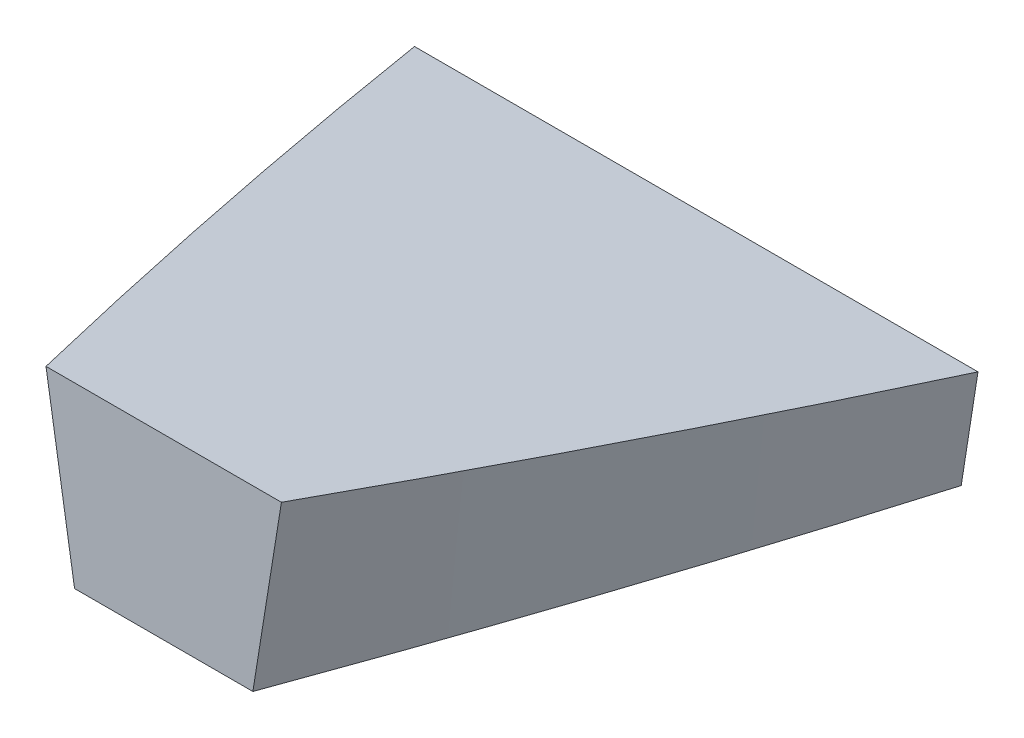
ISO-10303-21;
HEADER;
FILE_DESCRIPTION(('STEP AP214'),'2;1');
FILE_NAME('part.step','',(''),(''),'','','');
FILE_SCHEMA(('AUTOMOTIVE_DESIGN { 1 0 10303 214 1 1 1 1 }'));
ENDSEC;
DATA;
#1=APPLICATION_CONTEXT('core data for automotive mechanical design processes');
#2=APPLICATION_PROTOCOL_DEFINITION('international standard','automotive_design',2000,#1);
#3=PRODUCT_CONTEXT('',#1,'mechanical');
#4=PRODUCT('Part','Part','',(#3));
#5=PRODUCT_RELATED_PRODUCT_CATEGORY('part','',(#4));
#6=PRODUCT_DEFINITION_FORMATION('','',#4);
#7=PRODUCT_DEFINITION_CONTEXT('part definition',#1,'design');
#8=PRODUCT_DEFINITION('design','',#6,#7);
#9=PRODUCT_DEFINITION_SHAPE('','',#8);
#10=(LENGTH_UNIT() NAMED_UNIT(*) SI_UNIT(.MILLI.,.METRE.));
#11=(NAMED_UNIT(*) PLANE_ANGLE_UNIT() SI_UNIT($,.RADIAN.));
#12=(NAMED_UNIT(*) SI_UNIT($,.STERADIAN.) SOLID_ANGLE_UNIT());
#13=UNCERTAINTY_MEASURE_WITH_UNIT(LENGTH_MEASURE(1.E-05),#10,'distance_accuracy_value','');
#14=(GEOMETRIC_REPRESENTATION_CONTEXT(3) GLOBAL_UNCERTAINTY_ASSIGNED_CONTEXT((#13)) GLOBAL_UNIT_ASSIGNED_CONTEXT((#10,
#11,#12)) REPRESENTATION_CONTEXT('',''));
#15=CARTESIAN_POINT('',(0.,0.,0.));
#16=DIRECTION('',(0.,0.,1.));
#17=DIRECTION('',(1.,0.,0.));
#18=AXIS2_PLACEMENT_3D('',#15,#16,#17);
#19=CARTESIAN_POINT('',(0.,0.,1033.18442870201));
#20=DIRECTION('',(0.,0.,-1.));
#21=DIRECTION('',(-1.,0.,0.));
#22=AXIS2_PLACEMENT_3D('',#19,#20,#21);
#23=PLANE('',#22);
#24=DIRECTION('',(1.,0.,0.));
#25=VECTOR('',#24,1.);
#26=CARTESIAN_POINT('',(-123.764421645396,0.,1033.18442870201));
#27=LINE('',#26,#25);
#28=CARTESIAN_POINT('',(-106.025683326442,0.,1033.18442870118));
#29=VERTEX_POINT('',#28);
#30=CARTESIAN_POINT('',(121.462133420714,0.,1033.18442870116));
#31=VERTEX_POINT('',#30);
#32=EDGE_CURVE('E104',#29,#31,#27,.T.);
#33=ORIENTED_EDGE('',*,*,#32,.F.);
#34=CARTESIAN_POINT('',(-118.106470541406,76.9365767459715,1033.18442870201));
#35=CARTESIAN_POINT('',(-116.093228938327,64.1137736749483,1033.18442870201));
#36=CARTESIAN_POINT('',(-114.079859067178,51.290990745257,1033.18442870201));
#37=CARTESIAN_POINT('',(-110.052862787958,25.6454651635593,1033.18442870202));
#38=CARTESIAN_POINT('',(-108.039236379886,12.8227225115528,1033.18442870202));
#39=CARTESIAN_POINT('',(-106.025481703744,8.78260368680306E-10,1033.18442870203));
#40=B_SPLINE_CURVE_WITH_KNOTS('',3,(#34,#35,#36,#37,#38,#39),.UNSPECIFIED.,.F.,.F.,(4,2,4),(0.,
38.9396556571869,77.8793113294938),.UNSPECIFIED.);
#41=CARTESIAN_POINT('',(-113.229700788441,45.8769360412904,1033.18442870201));
#42=VERTEX_POINT('',#41);
#43=EDGE_CURVE('E91',#42,#29,#40,.T.);
#44=ORIENTED_EDGE('',*,*,#43,.F.);
#45=DIRECTION('',(1.,0.,0.));
#46=VECTOR('',#45,1.);
#47=CARTESIAN_POINT('',(0.,45.8769360412903,1033.18442870201));
#48=LINE('',#47,#46);
#49=CARTESIAN_POINT('',(128.666146601839,45.8769360412903,1033.18442870201));
#50=VERTEX_POINT('',#49);
#51=EDGE_CURVE('E102',#42,#50,#48,.T.);
#52=ORIENTED_EDGE('',*,*,#51,.T.);
#53=CARTESIAN_POINT('',(121.46192751701,0.,1033.18442870201));
#54=CARTESIAN_POINT('',(123.475682192377,12.8227225057619,1033.18442870201));
#55=CARTESIAN_POINT('',(125.489308599675,25.6454651528556,1033.18442870201));
#56=CARTESIAN_POINT('',(129.51630487894,51.290990734846,1033.18442870201));
#57=CARTESIAN_POINT('',(131.529674750906,64.1137736697428,1033.18442870201));
#58=CARTESIAN_POINT('',(133.542916354803,76.9365767459714,1033.18442870201));
#59=B_SPLINE_CURVE_WITH_KNOTS('',3,(#53,#54,#55,#56,#57,#58),.UNSPECIFIED.,.F.,.F.,(4,2,4),(0.,
38.939655657387,77.8793113303819),.UNSPECIFIED.);
#60=EDGE_CURVE('E105',#31,#50,#59,.T.);
#61=ORIENTED_EDGE('',*,*,#60,.F.);
#62=EDGE_LOOP('',(#33,#44,#52,#61));
#63=FACE_BOUND('',#62,.T.);
#64=ADVANCED_FACE('F34',(#63),#23,.T.);
#65=CARTESIAN_POINT('',(-123.764421645396,0.,971.228223196015));
#66=DIRECTION('',(0.,-1.,0.));
#67=DIRECTION('',(0.,0.,-1.));
#68=AXIS2_PLACEMENT_3D('',#65,#66,#67);
#69=PLANE('',#68);
#70=CARTESIAN_POINT('',(-170.289770142453,0.,785.339473226677));
#71=CARTESIAN_POINT('',(-167.825772421889,0.,796.353082344623));
#72=CARTESIAN_POINT('',(-160.999165467227,0.,826.241748411276));
#73=CARTESIAN_POINT('',(-149.252675491013,0.,874.959703685039));
#74=CARTESIAN_POINT('',(-120.211836445313,0.,987.796815406518));
#75=CARTESIAN_POINT('',(-92.3477273162206,0.,1081.13996125716));
#76=CARTESIAN_POINT('',(-67.767522398365,0.,1155.10442870201));
#77=B_SPLINE_CURVE_WITH_KNOTS('',3,(#70,#71,#72,#73,#74,#75,#76),.UNSPECIFIED.,.F.,.F.,(4,1,1,1,
4),(0.794288290696745,0.8125,0.84375,0.875,1.),.UNSPECIFIED.);
#78=CARTESIAN_POINT('',(-67.7675223983649,0.,1155.10442870201));
#79=VERTEX_POINT('',#78);
#80=EDGE_CURVE('E48',#29,#79,#77,.T.);
#81=ORIENTED_EDGE('',*,*,#80,.F.);
#82=ORIENTED_EDGE('',*,*,#32,.T.);
#83=CARTESIAN_POINT('',(83.2039682117622,0.,1155.10442870201));
#84=CARTESIAN_POINT('',(107.784173129618,0.,1081.13996125716));
#85=CARTESIAN_POINT('',(135.64828225871,0.,987.796815406518));
#86=CARTESIAN_POINT('',(164.68912130441,0.,874.959703685039));
#87=CARTESIAN_POINT('',(176.435611280623,0.,826.241748411283));
#88=CARTESIAN_POINT('',(183.262218235284,0.,796.353082344636));
#89=CARTESIAN_POINT('',(185.726215955846,0.,785.339473226696));
#90=B_SPLINE_CURVE_WITH_KNOTS('',3,(#83,#84,#85,#86,#87,#88,#89),.UNSPECIFIED.,.F.,.F.,(4,1,1,1,
4),(0.00273138969491729,0.127731389694917,0.158981389694917,0.190231389694917,
0.208443098998162),.UNSPECIFIED.);
#91=CARTESIAN_POINT('',(83.2039682117622,0.,1155.10442870201));
#92=VERTEX_POINT('',#91);
#93=EDGE_CURVE('E97',#92,#31,#90,.T.);
#94=ORIENTED_EDGE('',*,*,#93,.F.);
#95=CARTESIAN_POINT('',(35.2929058352083,0.,1290.66144621356));
#96=CARTESIAN_POINT('',(52.2219313725927,0.,1245.49766233588));
#97=CARTESIAN_POINT('',(67.9931249046609,0.,1200.87548424678));
#98=CARTESIAN_POINT('',(83.2039682117621,0.,1155.10442870201));
#99=B_SPLINE_CURVE_WITH_KNOTS('',3,(#95,#96,#97,#98),.UNSPECIFIED.,.F.,.F.,(4,4),(0.,1.),.UNSPECIFIED.);
#100=CARTESIAN_POINT('',(45.9859426583799,0.,1261.78442870294));
#101=VERTEX_POINT('',#100);
#102=EDGE_CURVE('E56',#101,#92,#99,.T.);
#103=ORIENTED_EDGE('',*,*,#102,.F.);
#104=DIRECTION('',(1.,0.,0.));
#105=VECTOR('',#104,1.);
#106=CARTESIAN_POINT('',(-123.764421645396,0.,1261.78442870201));
#107=LINE('',#106,#105);
#108=CARTESIAN_POINT('',(-30.5494957021117,0.,1261.78442870296));
#109=VERTEX_POINT('',#108);
#110=EDGE_CURVE('E228',#109,#101,#107,.T.);
#111=ORIENTED_EDGE('',*,*,#110,.F.);
#112=CARTESIAN_POINT('',(-67.7675223983649,0.,1155.10442870201));
#113=CARTESIAN_POINT('',(-52.556679091263,0.,1200.87548424678));
#114=CARTESIAN_POINT('',(-36.7854855591942,0.,1245.49766233588));
#115=CARTESIAN_POINT('',(-19.8564600218092,0.,1290.66144621356));
#116=B_SPLINE_CURVE_WITH_KNOTS('',3,(#112,#113,#114,#115),.UNSPECIFIED.,.F.,.F.,(4,4),(0.,1.),.UNSPECIFIED.);
#117=EDGE_CURVE('E221',#79,#109,#116,.T.);
#118=ORIENTED_EDGE('',*,*,#117,.F.);
#119=EDGE_LOOP('',(#81,#82,#94,#103,#111,#118));
#120=FACE_BOUND('',#119,.T.);
#121=ADVANCED_FACE('F122',(#120),#69,.T.);
#122=CARTESIAN_POINT('',(7.71822290670033,0.,1345.60442870201));
#123=CARTESIAN_POINT('',(7.71822290670033,87.6979944450598,1358.81242870201));
#124=CARTESIAN_POINT('',(8.10743528494052,0.,1345.60442870201));
#125=CARTESIAN_POINT('',(8.12724026827437,87.6979944450598,1358.81242870201));
#126=CARTESIAN_POINT('',(8.75508571448784,0.,1345.56052568011));
#127=CARTESIAN_POINT('',(8.97319661845631,87.6979944450598,1358.79028540965));
#128=CARTESIAN_POINT('',(9.57165843202123,0.,1345.43316148124));
#129=CARTESIAN_POINT('',(10.3317431818745,87.6979944450598,1358.67503744139));
#130=CARTESIAN_POINT('',(10.2875514797332,0.,1345.26000515088));
#131=CARTESIAN_POINT('',(11.7857489404816,87.6979944450598,1358.46215329079));
#132=CARTESIAN_POINT('',(10.939690496394,0.,1345.05110001895));
#133=CARTESIAN_POINT('',(13.3334694360532,87.6979944450599,1358.12767564935));
#134=CARTESIAN_POINT('',(11.5420185527259,0.,1344.8100390265));
#135=CARTESIAN_POINT('',(14.9731602103647,87.69799444506,1357.64764720858));
#136=CARTESIAN_POINT('',(12.1067615852056,0.,1344.53968217589));
#137=CARTESIAN_POINT('',(16.6812255493726,87.69799444506,1356.99910216844));
#138=CARTESIAN_POINT('',(12.6402833982277,0.,1344.2403693277));
#139=CARTESIAN_POINT('',(18.434069739033,87.6979944450598,1356.15907472886));
#140=CARTESIAN_POINT('',(13.3168386236998,0.,1343.80209911395));
#141=CARTESIAN_POINT('',(20.7517811937159,87.6979944450596,1354.7927744667));
#142=CARTESIAN_POINT('',(14.1062560887791,0.,1343.17660371854));
#143=CARTESIAN_POINT('',(23.4641703921966,87.6979944450602,1352.64011635232));
#144=CARTESIAN_POINT('',(14.8383357387118,0.,1342.42913276985));
#145=CARTESIAN_POINT('',(25.5743560699719,87.6979944450597,1350.23081224927));
#146=CARTESIAN_POINT('',(15.3956799874643,0.,1341.72606263573));
#147=CARTESIAN_POINT('',(26.8838781864801,87.6979944450598,1348.33532915411));
#148=CARTESIAN_POINT('',(15.8008931441622,0.,1341.13074011889));
#149=CARTESIAN_POINT('',(27.6978449139644,87.69799444506,1346.94918772532));
#150=CARTESIAN_POINT('',(16.19576757427,0.,1340.43886716429));
#151=CARTESIAN_POINT('',(28.3647751345112,87.6979944450599,1345.61800798807));
#152=CARTESIAN_POINT('',(16.4539963903093,0.,1339.88077053606));
#153=CARTESIAN_POINT('',(28.7242973925143,87.6979944450598,1344.76942443889));
#154=CARTESIAN_POINT('',(17.9991736902126,0.,1335.92494004421));
#155=CARTESIAN_POINT('',(30.6575133581101,87.6979944450598,1339.82017061247));
#156=CARTESIAN_POINT('',(20.9583644565766,0.,1328.31624623871));
#157=CARTESIAN_POINT('',(33.9711236854347,87.6979944450599,1331.28696766163));
#158=CARTESIAN_POINT('',(25.7087778762393,0.,1315.97896954419));
#159=CARTESIAN_POINT('',(38.6118840613012,87.6979944450598,1319.21404001281));
#160=CARTESIAN_POINT('',(30.5900218898954,0.,1303.16468405729));
#161=CARTESIAN_POINT('',(43.1130656286996,87.6979944450598,1307.38696175443));
#162=CARTESIAN_POINT('',(33.7618140160018,0.,1294.74614086275));
#163=CARTESIAN_POINT('',(46.1242016708984,87.6979944450598,1299.39618007328));
#164=CARTESIAN_POINT('',(39.4984380448584,0.,1279.44179583334));
#165=CARTESIAN_POINT('',(51.8807345406513,87.6979944450598,1284.03872161536));
#166=CARTESIAN_POINT('',(47.8117583688451,0.,1256.94835030993));
#167=CARTESIAN_POINT('',(60.2086698415953,87.6979944450599,1261.49759678602));
#168=CARTESIAN_POINT('',(59.9647251773283,0.,1223.07960866854));
#169=CARTESIAN_POINT('',(72.3767562145426,87.6979944450598,1227.58155508116));
#170=CARTESIAN_POINT('',(71.7841981742406,0.,1189.11917820836));
#171=CARTESIAN_POINT('',(84.2326703371387,87.6979944450599,1193.5282528031));
#172=CARTESIAN_POINT('',(79.4355673743826,0.,1166.44395015788));
#173=CARTESIAN_POINT('',(91.9353949608194,87.6979944450599,1170.71212469187));
#174=CARTESIAN_POINT('',(88.2533566011425,0.,1139.91027859664));
#175=CARTESIAN_POINT('',(100.833142003973,87.6979944450598,1143.93786245568));
#176=CARTESIAN_POINT('',(98.1817923383555,0.,1109.39198516259));
#177=CARTESIAN_POINT('',(110.807039872266,87.6979944450598,1113.27461380874));
#178=CARTESIAN_POINT('',(112.532151848529,0.,1063.30970180671));
#179=CARTESIAN_POINT('',(125.14960295021,87.6979944450599,1067.21221326498));
#180=CARTESIAN_POINT('',(126.308946292052,0.,1017.00771171111));
#181=CARTESIAN_POINT('',(138.898865364075,87.6979944450598,1021.01316850358));
#182=CARTESIAN_POINT('',(139.487666783876,0.,970.575088797343));
#183=CARTESIAN_POINT('',(152.075597865083,87.69799444506,974.607706070568));
#184=CARTESIAN_POINT('',(149.951114829771,0.,931.846603955364));
#185=CARTESIAN_POINT('',(162.593313858213,87.6979944450598,935.704958203181));
#186=CARTESIAN_POINT('',(158.003037124975,0.,900.886527714706));
#187=CARTESIAN_POINT('',(170.736556652266,87.6979944450599,904.406622450725));
#188=CARTESIAN_POINT('',(163.880674594839,0.,877.688699120982));
#189=CARTESIAN_POINT('',(176.709711229527,87.6979944450598,880.834991629654));
#190=CARTESIAN_POINT('',(169.595121632379,0.,854.523971884333));
#191=CARTESIAN_POINT('',(182.549049136345,87.6979944450599,857.155352899428));
#192=CARTESIAN_POINT('',(174.220707413563,0.,835.255863704768));
#193=CARTESIAN_POINT('',(187.30514711943,87.6979944450598,837.323832101492));
#194=CARTESIAN_POINT('',(177.839027154552,0.,819.867823903748));
#195=CARTESIAN_POINT('',(191.045799873853,87.6979944450599,821.394466199786));
#196=CARTESIAN_POINT('',(180.511623309841,0.,808.341254432311));
#197=CARTESIAN_POINT('',(193.819261494727,87.6979944450597,809.413958557279));
#198=CARTESIAN_POINT('',(183.143006606201,0.,796.830382348215));
#199=CARTESIAN_POINT('',(196.55908898365,87.6979944450599,797.398158617155));
#200=CARTESIAN_POINT('',(184.869740758839,0.,789.167757222384));
#201=CARTESIAN_POINT('',(198.360276505289,87.6979944450598,789.36247149621));
#202=CARTESIAN_POINT('',(185.726215955846,0.,785.339473226696));
#203=CARTESIAN_POINT('',(199.260723543644,87.6979944450598,785.339473226529));
#204=B_SPLINE_SURFACE_WITH_KNOTS('',3,1,((#122,#123),(#124,#125),(#126,#127),(#128,#129),(#130,
#131),(#132,#133),(#134,#135),(#136,#137),(#138,#139),(#140,#141),(#142,#143),(#144,#145),(#146,
#147),(#148,#149),(#150,#151),(#152,#153),(#154,#155),(#156,#157),(#158,#159),(#160,#161),(#162,
#163),(#164,#165),(#166,#167),(#168,#169),(#170,#171),(#172,#173),(#174,#175),(#176,#177),(#178,
#179),(#180,#181),(#182,#183),(#184,#185),(#186,#187),(#188,#189),(#190,#191),(#192,#193),(#194,
#195),(#196,#197),(#198,#199),(#200,#201),(#202,#203)),.UNSPECIFIED.,.F.,.F.,.F.,(4,1,1,1,1,1,1,
1,1,1,1,1,1,1,2,1,1,1,2,1,1,1,2,1,1,1,1,1,1,1,1,1,1,1,1,4),(2,2),(0.,0.00198924260783937,
0.00397848521567873,0.0059677278235181,0.00795697043135747,0.00994621303919684,
0.0119354556470362,0.0139246982548756,0.0159139408627149,0.0198924260783937,0.0238709112940724,
0.0258601539019118,0.0278493965097511,0.0298386391175905,0.0318278817254299,0.0536185184832892,
0.0754091552411486,0.0971997919990079,0.118990428756867,0.178843942173828,0.238697455590788,
0.298550969007749,0.358404482424709,0.43860392212162,0.518803361818532,0.599002801515443,
0.679202241212355,0.759401680909266,0.799501400757722,0.839601120606178,0.879700840454633,
0.919800560303089,0.939850420227317,0.959900280151544,0.979950140075772,1.),(0.,1.),.UNSPECIFIED.);
#205=CARTESIAN_POINT('',(28.3542757226073,87.6979944450512,1345.60442870188));
#206=CARTESIAN_POINT('',(28.3879306663669,87.6877464233605,1345.52787188919));
#207=CARTESIAN_POINT('',(28.4211548852475,87.6774734998239,1345.45112904974));
#208=CARTESIAN_POINT('',(28.4867385478705,87.6568785590083,1345.29727662097));
#209=CARTESIAN_POINT('',(28.5190979475732,87.6465565392606,1345.22016701321));
#210=CARTESIAN_POINT('',(28.5829299206545,87.6258701175173,1345.06563118538));
#211=CARTESIAN_POINT('',(28.6144029117256,87.615505738211,1344.98820513481));
#212=CARTESIAN_POINT('',(28.6764753345324,87.5947314138247,1344.83301263915));
#213=CARTESIAN_POINT('',(28.707074793412,87.5843214701721,1344.75524620473));
#214=CARTESIAN_POINT('',(28.7673957652413,87.5634562101125,1344.59937438329));
#215=CARTESIAN_POINT('',(28.797117229646,87.5530008912331,1344.52126897781));
#216=CARTESIAN_POINT('',(28.8337309472117,87.5399052794955,1344.42343953075));
#217=CARTESIAN_POINT('',(28.8410269212745,87.5372847847293,1344.40386338882));
#218=CARTESIAN_POINT('',(28.8555555902512,87.5320407068096,1344.36468803348));
#219=CARTESIAN_POINT('',(28.8627882851086,87.5294171236532,1344.34508882005));
#220=CARTESIAN_POINT('',(28.8844844338459,87.5215462674478,1344.28629038238));
#221=CARTESIAN_POINT('',(28.8989459127189,87.5162989018668,1344.2470904669));
#222=CARTESIAN_POINT('',(28.9423238847888,87.500558815622,1344.12950573967));
#223=CARTESIAN_POINT('',(28.9712395693672,87.4900660533257,1344.05112061692));
#224=CARTESIAN_POINT('',(29.0290647612209,87.4690803638671,1343.8943491398));
#225=CARTESIAN_POINT('',(29.0579742685616,87.458587436708,1343.81596278546));
#226=CARTESIAN_POINT('',(29.1446998504573,87.4271066599672,1343.58078881702));
#227=CARTESIAN_POINT('',(29.2025084820928,87.4061184489687,1343.42399850299));
#228=CARTESIAN_POINT('',(29.3181062190722,87.3641406201502,1343.11040736541));
#229=CARTESIAN_POINT('',(29.3758953240164,87.3431510023109,1342.95360654172));
#230=CARTESIAN_POINT('',(29.5203303872624,87.2906800754465,1342.56162777321));
#231=CARTESIAN_POINT('',(29.6069635069627,87.2591981442435,1342.32644518047));
#232=CARTESIAN_POINT('',(29.7801815216338,87.1962326218115,1341.85606759394));
#233=CARTESIAN_POINT('',(29.8667664174863,87.1647490306253,1341.62087260046));
#234=CARTESIAN_POINT('',(30.0398916252046,87.1017787810815,1341.15045970052));
#235=CARTESIAN_POINT('',(30.1264319358776,87.0702921226664,1340.91524179362));
#236=CARTESIAN_POINT('',(30.2994660105385,87.0073163685569,1340.44478777237));
#237=CARTESIAN_POINT('',(30.3859597742814,86.9758272728509,1340.20955165793));
#238=CARTESIAN_POINT('',(30.5588989787113,86.912847225466,1339.73906556421));
#239=CARTESIAN_POINT('',(30.6453444200326,86.8813562738178,1339.50381558514));
#240=CARTESIAN_POINT('',(30.8181878962516,86.8183721316128,1339.03329890147));
#241=CARTESIAN_POINT('',(30.904585931217,86.7868789410593,1338.79803219689));
#242=CARTESIAN_POINT('',(31.1637081390655,86.6923962409372,1338.09220871229));
#243=CARTESIAN_POINT('',(31.3363612462995,86.6294033001337,1337.62162629958));
#244=CARTESIAN_POINT('',(31.6814745723598,86.503409420895,1336.68040172866));
#245=CARTESIAN_POINT('',(31.8539347946524,86.440408482627,1336.20975957169));
#246=CARTESIAN_POINT('',(32.1986662592395,86.3143973892435,1335.26840640423));
#247=CARTESIAN_POINT('',(32.3709375012264,86.2513872341131,1334.79769539363));
#248=CARTESIAN_POINT('',(32.7152926927309,86.1253576172754,1333.85620384857));
#249=CARTESIAN_POINT('',(32.8873766414624,86.0623381555303,1333.38542331384));
#250=CARTESIAN_POINT('',(33.2313582233911,85.9362903164879,1332.44379564164));
#251=CARTESIAN_POINT('',(33.4032558566795,85.873261939195,1331.97294850421));
#252=CARTESIAN_POINT('',(33.918675436055,85.6841632987642,1330.56030617763));
#253=CARTESIAN_POINT('',(34.2619231097363,85.5580798754774,1329.61841267692));
#254=CARTESIAN_POINT('',(35.289333171038,85.1802224131156,1326.79566660361));
#255=CARTESIAN_POINT('',(35.9723816571374,84.9283950341645,1324.91441556084));
#256=CARTESIAN_POINT('',(37.3354836137527,84.4245976406602,1321.15084793041));
#257=CARTESIAN_POINT('',(38.0155370838956,84.1726276260893,1319.26853134262));
#258=CARTESIAN_POINT('',(40.0512055244051,83.416506144739,1313.62000205571));
#259=CARTESIAN_POINT('',(41.4023325206466,82.9121417707696,1309.85219885488));
#260=CARTESIAN_POINT('',(43.4200914958721,82.1551771232522,1304.19737078013));
#261=CARTESIAN_POINT('',(44.091188526748,81.9027861611387,1302.31190954617));
#262=CARTESIAN_POINT('',(45.430369620569,81.397863553069,1298.53993611379));
#263=CARTESIAN_POINT('',(46.098453683534,81.1453319071137,1296.65342391538));
#264=CARTESIAN_POINT('',(48.0982927947397,80.3875063580054,1290.9921645621));
#265=CARTESIAN_POINT('',(49.4255743320841,79.8820045163765,1287.21586402381));
#266=CARTESIAN_POINT('',(52.0681706481596,78.8704485194893,1279.65913694397));
#267=CARTESIAN_POINT('',(53.3834853850964,78.3643943623088,1275.87871038805));
#268=CARTESIAN_POINT('',(56.0021441654757,77.3517371471793,1268.31375676836));
#269=CARTESIAN_POINT('',(57.3054881167027,76.8451340850353,1264.52922967326));
#270=CARTESIAN_POINT('',(62.4979482356536,74.8164329143873,1249.37402213129));
#271=CARTESIAN_POINT('',(66.3389809676814,73.2921623456982,1237.98711253966));
#272=CARTESIAN_POINT('',(73.9122756854502,70.2388313741763,1215.1775113834));
#273=CARTESIAN_POINT('',(77.6445350034631,68.709770854884,1203.75481894876));
#274=CARTESIAN_POINT('',(83.1610577718104,66.4127117347571,1186.59487040367));
#275=CARTESIAN_POINT('',(84.9862697693365,65.646440657459,1180.8705195836));
#276=CARTESIAN_POINT('',(88.6094907882526,64.1127664822113,1169.41336129734));
#277=CARTESIAN_POINT('',(90.4074998060704,63.345363384113,1163.68055383004));
#278=CARTESIAN_POINT('',(93.976286495846,61.8094399437921,1152.20659263584));
#279=CARTESIAN_POINT('',(95.7470640528832,61.0409195968696,1146.46543887384));
#280=CARTESIAN_POINT('',(99.2612362345347,59.5027776537149,1134.97490457792));
#281=CARTESIAN_POINT('',(101.004630860706,58.7331560575455,1129.22552404446));
#282=CARTESIAN_POINT('',(104.464204352275,57.1927769135677,1117.71827696536));
#283=CARTESIAN_POINT('',(106.180381268507,56.4220192886854,1111.96040984395));
#284=CARTESIAN_POINT('',(109.585373179143,54.8794415279702,1100.4367382202));
#285=CARTESIAN_POINT('',(111.274188172624,54.1076213921015,1094.6709337176));
#286=CARTESIAN_POINT('',(116.299494027293,51.7906024116557,1077.36187704854));
#287=CARTESIAN_POINT('',(119.594879164864,50.2438301219454,1065.80687061887));
#288=CARTESIAN_POINT('',(126.075677194496,47.1462521306516,1042.66672656281));
#289=CARTESIAN_POINT('',(129.261090998751,45.5954464626391,1031.08158918721));
#290=CARTESIAN_POINT('',(135.521844403432,42.4899438192718,1007.88224481688));
#291=CARTESIAN_POINT('',(138.597185087343,40.9352468823815,996.26803810949));
#292=CARTESIAN_POINT('',(144.4748613613,37.905832426501,973.637102871828));
#293=CARTESIAN_POINT('',(147.282982951758,36.431312420809,962.621849844737));
#294=CARTESIAN_POINT('',(152.800066256829,33.4790191396748,940.567040566911));
#295=CARTESIAN_POINT('',(155.509028694028,32.0012458880226,929.527484493898));
#296=CARTESIAN_POINT('',(159.498020802643,29.7822377247431,912.950607752077));
#297=CARTESIAN_POINT('',(160.815275500431,29.0421773887134,907.422061631839));
#298=CARTESIAN_POINT('',(163.424919006405,27.5612847712009,896.359202650691));
#299=CARTESIAN_POINT('',(164.717307815969,26.820452489761,890.824889790102));
#300=CARTESIAN_POINT('',(167.276945658572,25.3381341109741,879.751379803112));
#301=CARTESIAN_POINT('',(168.54419821727,24.596648120775,874.21218347715));
#302=CARTESIAN_POINT('',(171.053744156258,23.112932900322,863.128238525338));
#303=CARTESIAN_POINT('',(172.296037535277,22.3707036700303,857.583489899205));
#304=CARTESIAN_POINT('',(174.755721700677,20.8855163445501,846.488547735218));
#305=CARTESIAN_POINT('',(175.97311239199,20.1425582465904,840.938354176663));
#306=CARTESIAN_POINT('',(178.383056871448,18.6559330152123,829.83267028165));
#307=CARTESIAN_POINT('',(179.575610660528,17.9122658818207,824.277179945392));
#308=CARTESIAN_POINT('',(181.345773191091,16.7962416474497,815.940033430928));
#309=CARTESIAN_POINT('',(181.932718337175,16.424144812814,813.1603215462));
#310=CARTESIAN_POINT('',(183.10033839059,15.6797778843162,807.599603461162));
#311=CARTESIAN_POINT('',(183.681013297918,15.3075077904541,804.818597260852));
#312=CARTESIAN_POINT('',(184.547270918051,14.7489729252328,800.646118867127));
#313=CARTESIAN_POINT('',(184.835231024138,14.5627730011828,799.255131108996));
#314=CARTESIAN_POINT('',(185.409548193949,14.1903296226686,796.472830403166));
#315=CARTESIAN_POINT('',(185.695905257626,14.0040861682032,795.081517455456));
#316=CARTESIAN_POINT('',(186.26709213078,13.6315580433983,792.298583661005));
#317=CARTESIAN_POINT('',(186.551921940235,13.4452733730582,790.90696281426));
#318=CARTESIAN_POINT('',(187.120134844813,13.0726652121866,788.123431118442));
#319=CARTESIAN_POINT('',(187.403517940072,12.8863417216587,786.731520269398));
#320=CARTESIAN_POINT('',(187.68621797702,12.7000000000191,785.339473226672));
#321=B_SPLINE_CURVE_WITH_KNOTS('',3,(#205,#206,#207,#208,#209,#210,#211,#212,#213,#214,#215,
#216,#217,#218,#219,#220,#221,#222,#223,#224,#225,#226,#227,#228,#229,#230,#231,#232,#233,#234,
#235,#236,#237,#238,#239,#240,#241,#242,#243,#244,#245,#246,#247,#248,#249,#250,#251,#252,#253,
#254,#255,#256,#257,#258,#259,#260,#261,#262,#263,#264,#265,#266,#267,#268,#269,#270,#271,#272,
#273,#274,#275,#276,#277,#278,#279,#280,#281,#282,#283,#284,#285,#286,#287,#288,#289,#290,#291,
#292,#293,#294,#295,#296,#297,#298,#299,#300,#301,#302,#303,#304,#305,#306,#307,#308,#309,#310,
#311,#312,#313,#314,#315,#316,#317,#318,#319,#320),.UNSPECIFIED.,.F.,.F.,(4,2,2,2,2,2,2,2,2,2,2,
2,2,2,2,2,2,2,2,2,2,2,2,2,2,2,2,2,2,2,2,2,2,2,2,2,2,2,2,2,2,2,2,2,2,2,2,2,2,2,2,2,2,2,2,2,2,4),
(0.,0.252758677415496,0.505530201775004,0.758180551877242,1.01082304263365,1.26347947617553,
1.3266451664708,1.38981091307026,1.51614274827675,1.76875701267162,2.02136845064755,
2.52663066190693,3.03190265526551,3.78970562655304,4.54749425403109,5.30530219882549,
6.06311409318998,6.82091579227358,7.5787164044546,9.0943103425807,10.6098765926928,
12.1254453051727,13.6410203541298,15.156594661984,18.18775165711,24.2393353143097,
30.2909197251815,42.3940532227149,48.4456071231867,54.497160983817,66.6008124726872,
78.7045062174125,90.808293123323,127.148419423029,163.489436235677,181.660259180327,
199.831084511031,218.001986504127,236.172887464089,254.345083889658,272.51728092724,
308.861324124873,345.205065782104,381.548449597587,415.936380805701,450.324061374877,
467.51788158563,484.711700842831,501.90309116007,519.094482352561,536.285939162155,
553.477395324433,562.073192696889,570.668990075253,574.96688945227,579.264788955168,
583.562688517981,587.860587675631),.UNSPECIFIED.);
#322=CARTESIAN_POINT('',(58.2457398478888,76.477710483073,1261.78442870201));
#323=VERTEX_POINT('',#322);
#324=EDGE_CURVE('E11',#323,#50,#321,.T.);
#325=CARTESIAN_POINT('',(45.9860815401597,0.,1261.78442870201));
#326=CARTESIAN_POINT('',(48.3296623028588,14.6162348765952,1261.78442870201));
#327=CARTESIAN_POINT('',(50.6729370327576,29.2325188213569,1261.78442870201));
#328=CARTESIAN_POINT('',(54.1873943077138,51.1570176564675,1261.78442870201));
#329=CARTESIAN_POINT('',(55.3588042636341,58.4651960935536,1261.78442870201));
#330=CARTESIAN_POINT('',(57.7014732733116,73.0815771570685,1261.78442870201));
#331=CARTESIAN_POINT('',(58.8727323270687,80.3897797834973,1261.78442870201));
#332=CARTESIAN_POINT('',(60.0439162817836,87.6979944450598,1261.78442870201));
#333=B_SPLINE_CURVE_WITH_KNOTS('',3,(#325,#326,#327,#328,#329,#330,#331,#332),.UNSPECIFIED.,.F.,
.F.,(4,2,2,4),(0.,44.4087855527718,66.6131783639227,88.8175711845568),.UNSPECIFIED.);
#334=EDGE_CURVE('E225',#101,#323,#333,.T.);
#335=ORIENTED_EDGE('',*,*,#93,.T.);
#336=ORIENTED_EDGE('',*,*,#60,.T.);
#337=ORIENTED_EDGE('',*,*,#324,.F.);
#338=ORIENTED_EDGE('',*,*,#334,.F.);
#339=ORIENTED_EDGE('',*,*,#102,.T.);
#340=EDGE_LOOP('',(#335,#336,#337,#338,#339));
#341=FACE_BOUND('',#340,.T.);
#342=ADVANCED_FACE('F131',(#341),#204,.T.);
#343=CARTESIAN_POINT('',(-170.289770142453,0.,785.339473226677));
#344=CARTESIAN_POINT('',(-183.824277730246,87.6979944450598,785.339473226529));
#345=CARTESIAN_POINT('',(-169.433294945445,0.,789.167757222372));
#346=CARTESIAN_POINT('',(-182.923830691893,87.6979944450598,789.362471496202));
#347=CARTESIAN_POINT('',(-167.706560792803,0.,796.830382348217));
#348=CARTESIAN_POINT('',(-181.122643170258,87.6979944450598,797.398158617132));
#349=CARTESIAN_POINT('',(-165.075177496438,0.,808.341254432333));
#350=CARTESIAN_POINT('',(-178.38281568134,87.6979944450599,809.41395855724));
#351=CARTESIAN_POINT('',(-162.402581341146,0.,819.867823903786));
#352=CARTESIAN_POINT('',(-175.609354060469,87.6979944450598,821.394466199728));
#353=CARTESIAN_POINT('',(-158.784261600152,0.,835.255863704824));
#354=CARTESIAN_POINT('',(-171.86870130605,87.6979944450599,837.32383210142));
#355=CARTESIAN_POINT('',(-154.158675818964,0.,854.523971884407));
#356=CARTESIAN_POINT('',(-167.11260332297,87.6979944450598,857.155352899335));
#357=CARTESIAN_POINT('',(-148.44422878142,0.,877.688699121069));
#358=CARTESIAN_POINT('',(-161.273265416155,87.6979944450599,880.834991629555));
#359=CARTESIAN_POINT('',(-142.566591311554,0.,900.886527714801));
#360=CARTESIAN_POINT('',(-155.300110838896,87.6979944450599,904.406622450617));
#361=CARTESIAN_POINT('',(-134.514669016348,0.,931.846603955461));
#362=CARTESIAN_POINT('',(-147.156868044842,87.6979944450598,935.704958203079));
#363=CARTESIAN_POINT('',(-124.051220970455,0.,970.575088797429));
#364=CARTESIAN_POINT('',(-136.639152051711,87.69799444506,974.60770607048));
#365=CARTESIAN_POINT('',(-110.872500478638,0.,1017.00771171117));
#366=CARTESIAN_POINT('',(-123.462419550695,87.6979944450597,1021.01316850352));
#367=CARTESIAN_POINT('',(-97.0957060351225,0.,1063.30970180674));
#368=CARTESIAN_POINT('',(-109.713157136823,87.6979944450601,1067.21221326495));
#369=CARTESIAN_POINT('',(-82.7453465249564,0.,1109.3919851626));
#370=CARTESIAN_POINT('',(-95.3705940588712,87.6979944450596,1113.27461380873));
#371=CARTESIAN_POINT('',(-72.8169107877455,0.,1139.91027859664));
#372=CARTESIAN_POINT('',(-85.3966961905756,87.6979944450598,1143.93786245568));
#373=CARTESIAN_POINT('',(-63.9991215609851,0.,1166.44395015788));
#374=CARTESIAN_POINT('',(-76.4989491474221,87.6979944450598,1170.71212469187));
#375=CARTESIAN_POINT('',(-56.3477523608427,0.,1189.11917820836));
#376=CARTESIAN_POINT('',(-68.7962245237413,87.6979944450599,1193.52825280309));
#377=CARTESIAN_POINT('',(-44.5282793639298,0.,1223.07960866853));
#378=CARTESIAN_POINT('',(-56.9403104011448,87.6979944450598,1227.58155508117));
#379=CARTESIAN_POINT('',(-32.3753125554459,0.,1256.94835030993));
#380=CARTESIAN_POINT('',(-44.7722240281968,87.6979944450598,1261.49759678602));
#381=CARTESIAN_POINT('',(-24.0619922314593,0.,1279.44179583334));
#382=CARTESIAN_POINT('',(-36.4442887272524,87.6979944450598,1284.03872161536));
#383=CARTESIAN_POINT('',(-18.3253682026027,0.,1294.74614086275));
#384=CARTESIAN_POINT('',(-30.6877558574996,87.6979944450598,1299.39618007327));
#385=CARTESIAN_POINT('',(-15.1535673831279,0.,1303.1646999154));
#386=CARTESIAN_POINT('',(-27.6765743372,87.6979944450597,1307.38709010705));
#387=CARTESIAN_POINT('',(-10.2723314188504,0.,1315.97898821709));
#388=CARTESIAN_POINT('',(-23.1753817872491,87.69799444506,1319.21417146406));
#389=CARTESIAN_POINT('',(-5.52194274067791,0.,1328.31616665409));
#390=CARTESIAN_POINT('',(-18.5347142510245,87.6979944450598,1331.28688150251));
#391=CARTESIAN_POINT('',(-2.56272787682532,0.,1335.92494004417));
#392=CARTESIAN_POINT('',(-15.221067544693,87.6979944450598,1339.82017061251));
#393=CARTESIAN_POINT('',(-1.01755057692127,0.,1339.88077053602));
#394=CARTESIAN_POINT('',(-13.287851579128,87.6979944450598,1344.76942443885));
#395=CARTESIAN_POINT('',(-0.759321567939283,0.,1340.43886726948));
#396=CARTESIAN_POINT('',(-12.928329322771,87.6979944450599,1345.61800798846));
#397=CARTESIAN_POINT('',(-0.364447537737686,0.,1341.13074020946));
#398=CARTESIAN_POINT('',(-12.2613991064022,87.6979944450599,1346.94918772738));
#399=CARTESIAN_POINT('',(0.0407664452265649,0.,1341.7260628502));
#400=CARTESIAN_POINT('',(-11.447432381686,87.6979944450599,1348.33532915826));
#401=CARTESIAN_POINT('',(0.598109238358271,0.,1342.42913288422));
#402=CARTESIAN_POINT('',(-10.1379102618291,87.6979944450598,1350.230812251));
#403=CARTESIAN_POINT('',(1.3301919602528,0.,1343.17660417421));
#404=CARTESIAN_POINT('',(-8.0277245569943,87.6979944450599,1352.64011633032));
#405=CARTESIAN_POINT('',(2.11960505340114,0.,1343.80209897589));
#406=CARTESIAN_POINT('',(-5.31533536745382,87.6979944450599,1354.7927744481));
#407=CARTESIAN_POINT('',(2.79616220239869,0.,1344.24037062286));
#408=CARTESIAN_POINT('',(-2.99762393245185,87.6979944450599,1356.15907474723));
#409=CARTESIAN_POINT('',(3.32968188623499,0.,1344.53968209585));
#410=CARTESIAN_POINT('',(-1.2447797523488,87.6979944450599,1356.9991022042));
#411=CARTESIAN_POINT('',(3.89443205848705,0.,1344.81003747838));
#412=CARTESIAN_POINT('',(0.463285593772605,87.6979944450598,1357.647647224));
#413=CARTESIAN_POINT('',(4.49674722489177,0.,1345.05110235882));
#414=CARTESIAN_POINT('',(2.10297637894691,87.6979944450597,1358.12767563465));
#415=CARTESIAN_POINT('',(5.14885525737893,0.,1345.26001810784));
#416=CARTESIAN_POINT('',(3.65069687620849,87.6979944450598,1358.46215326418));
#417=CARTESIAN_POINT('',(5.86480960631792,0.,1345.4331539915));
#418=CARTESIAN_POINT('',(5.10470263258663,87.69799444506,1358.67503741819));
#419=CARTESIAN_POINT('',(6.68134797015943,0.,1345.56052970167));
#420=CARTESIAN_POINT('',(6.46324919511059,87.6979944450599,1358.7902854023));
#421=CARTESIAN_POINT('',(7.32901052850247,0.,1345.60442870201));
#422=CARTESIAN_POINT('',(7.30920554517161,87.6979944450598,1358.81242870201));
#423=CARTESIAN_POINT('',(7.71822290670033,0.,1345.60442870201));
#424=CARTESIAN_POINT('',(7.71822290670033,87.6979944450598,1358.81242870201));
#425=B_SPLINE_SURFACE_WITH_KNOTS('',3,1,((#343,#344),(#345,#346),(#347,#348),(#349,#350),(#351,
#352),(#353,#354),(#355,#356),(#357,#358),(#359,#360),(#361,#362),(#363,#364),(#365,#366),(#367,
#368),(#369,#370),(#371,#372),(#373,#374),(#375,#376),(#377,#378),(#379,#380),(#381,#382),(#383,
#384),(#385,#386),(#387,#388),(#389,#390),(#391,#392),(#393,#394),(#395,#396),(#397,#398),(#399,
#400),(#401,#402),(#403,#404),(#405,#406),(#407,#408),(#409,#410),(#411,#412),(#413,#414),(#415,
#416),(#417,#418),(#419,#420),(#421,#422),(#423,#424)),.UNSPECIFIED.,.F.,.F.,.F.,(4,1,1,1,1,1,1,
1,1,1,1,1,1,2,1,1,1,2,1,1,1,2,1,1,1,1,1,1,1,1,1,1,1,1,1,4),(2,2),(0.,0.0200498599243005,
0.0400997198486011,0.0601495797729016,0.0801994396972022,0.120299159545803,0.160398879394404,
0.200498599243005,0.240598319091607,0.320797758788809,0.400997198486011,0.481196638183213,
0.561396077880415,0.641595517577617,0.701449030994794,0.76130254441197,0.821156057829146,
0.881009571246322,0.902800208004262,0.924590844762202,0.946381481520142,0.968172118278082,
0.970161360885702,0.972150603493322,0.974139846100942,0.976129088708562,0.980107573923801,
0.984086059139041,0.986075301746661,0.988064544354281,0.990053786961901,0.992043029569521,
0.99403227217714,0.99602151478476,0.99801075739238,1.),(0.,1.),.UNSPECIFIED.);
#426=CARTESIAN_POINT('',(-172.249772163626,12.700000000017,785.339473226656));
#427=CARTESIAN_POINT('',(-171.884844292422,12.9405375654049,787.136384855552));
#428=CARTESIAN_POINT('',(-171.518787556206,13.1810450206066,788.933071549339));
#429=CARTESIAN_POINT('',(-170.784225947841,13.6619940593601,792.525952849393));
#430=CARTESIAN_POINT('',(-170.415721076128,13.9024356429237,794.322147455749));
#431=CARTESIAN_POINT('',(-169.676072711767,14.3832473398125,797.91400275725));
#432=CARTESIAN_POINT('',(-169.304929219485,14.6236174531476,799.709663452471));
#433=CARTESIAN_POINT('',(-168.55998901235,15.1042853232258,803.300444310286));
#434=CARTESIAN_POINT('',(-168.186192296901,15.3445830799525,805.095564472759));
#435=CARTESIAN_POINT('',(-167.060876029895,16.0653652975184,810.480095352819));
#436=CARTESIAN_POINT('',(-166.305425510667,16.5457418562086,814.068699998284));
#437=CARTESIAN_POINT('',(-164.784142531107,17.5062054886567,821.243746721214));
#438=CARTESIAN_POINT('',(-164.018310065242,17.9862925622601,824.830188797526));
#439=CARTESIAN_POINT('',(-161.705293559404,19.4261150659799,835.586237634673));
#440=CARTESIAN_POINT('',(-160.14258903951,20.3854126574726,842.752573566218));
#441=CARTESIAN_POINT('',(-156.975697964468,22.3028061255308,857.076268139111));
#442=CARTESIAN_POINT('',(-155.371511156101,23.2609019947232,864.233626725381));
#443=CARTESIAN_POINT('',(-150.496453265421,26.1333579216938,885.692019098904));
#444=CARTESIAN_POINT('',(-147.16312890602,28.0458587850851,899.979163961954));
#445=CARTESIAN_POINT('',(-140.331056661824,31.8656519598023,928.514543725025));
#446=CARTESIAN_POINT('',(-136.832308754316,33.772944270413,942.762778619704));
#447=CARTESIAN_POINT('',(-131.460376216814,36.6297807713083,964.104487645635));
#448=CARTESIAN_POINT('',(-129.64908836118,37.5813802851933,971.213315864606));
#449=CARTESIAN_POINT('',(-125.98528719779,39.4831758283982,985.420487712617));
#450=CARTESIAN_POINT('',(-124.132774153838,40.4333718666575,992.518831408439));
#451=CARTESIAN_POINT('',(-120.386628681201,42.3323371973825,1006.70486043949));
#452=CARTESIAN_POINT('',(-118.492996202628,43.2811064881157,1013.79254576177));
#453=CARTESIAN_POINT('',(-114.664690839294,45.1771922612235,1027.95706334799));
#454=CARTESIAN_POINT('',(-112.730017675294,46.1245087336661,1035.03389553772));
#455=CARTESIAN_POINT('',(-106.864569641941,48.9641742756272,1056.24733064628));
#456=CARTESIAN_POINT('',(-102.872261976805,50.8542923193841,1070.3672669121));
#457=CARTESIAN_POINT('',(-94.7241103724644,54.6283086733282,1098.56067555125));
#458=CARTESIAN_POINT('',(-90.5682669264496,56.5122070022541,1112.63414806456));
#459=CARTESIAN_POINT('',(-84.9424753166683,59.0090884926749,1131.28684947891));
#460=CARTESIAN_POINT('',(-83.5452838602664,59.6249682033881,1135.88771675881));
#461=CARTESIAN_POINT('',(-80.7333759018464,60.8560209485046,1145.08417216451));
#462=CARTESIAN_POINT('',(-79.3186594706135,61.4711939857515,1149.67976031154));
#463=CARTESIAN_POINT('',(-76.4717329089354,62.7008263099042,1158.86560460565));
#464=CARTESIAN_POINT('',(-75.0395227933147,63.3152855974144,1163.45586075724));
#465=CARTESIAN_POINT('',(-72.1577096108026,64.5434864840642,1172.63101164181));
#466=CARTESIAN_POINT('',(-70.7081065258135,65.1572280824562,1177.21590636921));
#467=CARTESIAN_POINT('',(-67.7914592779473,66.3839683639214,1186.38014595002));
#468=CARTESIAN_POINT('',(-66.3244154541159,66.9969670611821,1190.95949090943));
#469=CARTESIAN_POINT('',(-63.3728573263197,68.2222230223636,1200.11264202522));
#470=CARTESIAN_POINT('',(-61.8883430241949,68.8344802863626,1204.6864481822));
#471=CARTESIAN_POINT('',(-57.4086063441226,70.670124543875,1218.39944352046));
#472=CARTESIAN_POINT('',(-54.3871790449657,71.8923886916641,1227.53024459598));
#473=CARTESIAN_POINT('',(-49.8015732732856,73.7239845692172,1241.21299691995));
#474=CARTESIAN_POINT('',(-48.2634793500622,74.3344688404672,1245.77355811337));
#475=CARTESIAN_POINT('',(-45.1699052302251,75.5546605251016,1254.88887706185));
#476=CARTESIAN_POINT('',(-43.6144250701343,76.164367940115,1259.44363482908));
#477=CARTESIAN_POINT('',(-40.4861324559759,77.3829947693934,1268.54726368341));
#478=CARTESIAN_POINT('',(-38.9133201191764,77.991914188959,1273.09613481011));
#479=CARTESIAN_POINT('',(-35.7503730493768,79.208961722332,1282.18796569362));
#480=CARTESIAN_POINT('',(-34.1602382897246,79.8170898349203,1286.73092544132));
#481=CARTESIAN_POINT('',(-31.4953672382996,80.8300703340821,1294.29829412178));
#482=CARTESIAN_POINT('',(-30.4254234670945,81.2351447682727,1297.32436183886));
#483=CARTESIAN_POINT('',(-28.8147099455783,81.8424855010376,1301.86143954499));
#484=CARTESIAN_POINT('',(-28.2768393025384,82.0448871934476,1303.37346098003));
#485=CARTESIAN_POINT('',(-27.1991799258667,82.4496007245766,1306.39683260718));
#486=CARTESIAN_POINT('',(-26.6593911918295,82.6519125632766,1307.90818279914));
#487=CARTESIAN_POINT('',(-25.577903234928,83.0564458433773,1310.93020787916));
#488=CARTESIAN_POINT('',(-25.0362040161458,83.2586672849701,1312.44088276865));
#489=CARTESIAN_POINT('',(-23.9508691448044,83.6630185442314,1315.46154808034));
#490=CARTESIAN_POINT('',(-23.4072334933119,83.8651483619502,1316.97153850292));
#491=CARTESIAN_POINT('',(-22.3180460102808,84.2693198063177,1319.99086052557));
#492=CARTESIAN_POINT('',(-21.7724941560814,84.4713614318915,1321.50019211762));
#493=CARTESIAN_POINT('',(-20.9527200068272,84.7743551245043,1323.76367594752));
#494=CARTESIAN_POINT('',(-20.6792207032261,84.8753416352928,1324.51808549392));
#495=CARTESIAN_POINT('',(-20.1317401712467,85.077291691238,1326.0267330243));
#496=CARTESIAN_POINT('',(-19.8577589427356,85.1782552363883,1326.78097100822));
#497=CARTESIAN_POINT('',(-19.309316532284,85.3801595939316,1328.28927715328));
#498=CARTESIAN_POINT('',(-19.0348553494277,85.4811004062808,1329.04334531411));
#499=CARTESIAN_POINT('',(-18.4854603943056,85.6829592877489,1330.55131173474));
#500=CARTESIAN_POINT('',(-18.2105266224581,85.7838773568879,1331.3052099947));
#501=CARTESIAN_POINT('',(-17.6601888200002,85.9856904018939,1332.81283399867));
#502=CARTESIAN_POINT('',(-17.3847847915339,86.0865853778638,1333.56655974344));
#503=CARTESIAN_POINT('',(-16.8334931715955,86.2883523904536,1335.07383986688));
#504=CARTESIAN_POINT('',(-16.5576055787763,86.3892244270087,1335.82739424507));
#505=CARTESIAN_POINT('',(-16.0973833649437,86.557326619363,1337.08318472336));
#506=CARTESIAN_POINT('',(-15.913183749717,86.6245632821375,1337.58546943316));
#507=CARTESIAN_POINT('',(-15.6367225606402,86.7254103544489,1338.33883731848));
#508=CARTESIAN_POINT('',(-15.5445420091057,86.7590246742022,1338.58994970487));
#509=CARTESIAN_POINT('',(-15.3601268618153,86.8262507527881,1339.09215534656));
#510=CARTESIAN_POINT('',(-15.2678922659901,86.8598625116175,1339.34324860183));
#511=CARTESIAN_POINT('',(-15.0833699388937,86.9270831865401,1339.845413876));
#512=CARTESIAN_POINT('',(-14.9910822080112,86.9606921026521,1340.09648589504));
#513=CARTESIAN_POINT('',(-14.8064535504081,87.0279071864694,1340.59860940142));
#514=CARTESIAN_POINT('',(-14.7141126239356,87.0615133541867,1340.84966088885));
#515=CARTESIAN_POINT('',(-14.5293745618555,87.1287241266419,1341.35175218763));
#516=CARTESIAN_POINT('',(-14.4369774246255,87.1623287313012,1341.6027919984));
#517=CARTESIAN_POINT('',(-14.2521284773971,87.2295359310867,1342.10485660791));
#518=CARTESIAN_POINT('',(-14.1596766665093,87.2631385261699,1342.35588140634));
#519=CARTESIAN_POINT('',(-14.0209573116198,87.3135412206974,1342.73240965372));
#520=CARTESIAN_POINT('',(-13.974709591491,87.3303422806299,1342.8579202779));
#521=CARTESIAN_POINT('',(-13.8822014309117,87.3639436229252,1343.1089357175));
#522=CARTESIAN_POINT('',(-13.8359409905722,87.3807439052934,1343.23444053297));
#523=CARTESIAN_POINT('',(-13.7434101272804,87.414342611323,1343.48543627861));
#524=CARTESIAN_POINT('',(-13.6971397052899,87.4311410350311,1343.61092720915));
#525=CARTESIAN_POINT('',(-13.6277241009114,87.4563384903439,1343.79916225841));
#526=CARTESIAN_POINT('',(-13.6045835355677,87.4647377458514,1343.86190804978));
#527=CARTESIAN_POINT('',(-13.5582981123813,87.4815360464916,1343.98739806095));
#528=CARTESIAN_POINT('',(-13.5351532545395,87.4899350916242,1344.05014228074));
#529=CARTESIAN_POINT('',(-13.4965752784347,87.5039349058414,1344.15472648125));
#530=CARTESIAN_POINT('',(-13.4811419661051,87.5095356654958,1344.19656639152));
#531=CARTESIAN_POINT('',(-13.4579848315348,87.5179364601004,1344.25932368057));
#532=CARTESIAN_POINT('',(-13.4502645888621,87.5207366687471,1344.28024235692));
#533=CARTESIAN_POINT('',(-13.4348350128373,87.5263376154446,1344.32208366448));
#534=CARTESIAN_POINT('',(-13.4271256794853,87.5291383534955,1344.34300629569));
#535=CARTESIAN_POINT('',(-13.4039109527897,87.5375360703339,1344.40574059259));
#536=CARTESIAN_POINT('',(-13.3883181395576,87.5431288069338,1344.44752056745));
#537=CARTESIAN_POINT('',(-13.3568787937941,87.5543016800076,1344.53098638919));
#538=CARTESIAN_POINT('',(-13.3410322620478,87.5598818165204,1344.57267223637));
#539=CARTESIAN_POINT('',(-13.2931213462512,87.5766028169971,1344.69758478445));
#540=CARTESIAN_POINT('',(-13.2606838726867,87.5877249119798,1344.78067127358));
#541=CARTESIAN_POINT('',(-13.1948078314721,87.6099185390898,1344.94646652713));
#542=CARTESIAN_POINT('',(-13.1613691255852,87.6209900639895,1345.02917523756));
#543=CARTESIAN_POINT('',(-13.0934946479919,87.64308105157,1345.19420373285));
#544=CARTESIAN_POINT('',(-13.0590587331528,87.6541005065103,1345.27652345989));
#545=CARTESIAN_POINT('',(-12.9891890878995,87.6760875985931,1345.44077581434));
#546=CARTESIAN_POINT('',(-12.9537550525055,87.6870552186751,1345.5227083143));
#547=CARTESIAN_POINT('',(-12.917829918689,87.6979944428044,1345.60442868516));
#548=B_SPLINE_CURVE_WITH_KNOTS('',3,(#426,#427,#428,#429,#430,#431,#432,#433,#434,#435,#436,
#437,#438,#439,#440,#441,#442,#443,#444,#445,#446,#447,#448,#449,#450,#451,#452,#453,#454,#455,
#456,#457,#458,#459,#460,#461,#462,#463,#464,#465,#466,#467,#468,#469,#470,#471,#472,#473,#474,
#475,#476,#477,#478,#479,#480,#481,#482,#483,#484,#485,#486,#487,#488,#489,#490,#491,#492,#493,
#494,#495,#496,#497,#498,#499,#500,#501,#502,#503,#504,#505,#506,#507,#508,#509,#510,#511,#512,
#513,#514,#515,#516,#517,#518,#519,#520,#521,#522,#523,#524,#525,#526,#527,#528,#529,#530,#531,
#532,#533,#534,#535,#536,#537,#538,#539,#540,#541,#542,#543,#544,#545,#546,#547),.UNSPECIFIED.,
.F.,.F.,(4,2,2,2,2,2,2,2,2,2,2,2,2,2,2,2,2,2,2,2,2,2,2,2,2,2,2,2,2,2,2,2,2,2,2,2,2,2,2,2,2,2,2,
2,2,2,2,2,2,2,2,2,2,2,2,2,2,2,2,2,4),(0.,5.54790945527993,11.0958179178729,16.6437256098348,
22.1916345488441,33.2873797226809,44.3831308087152,66.574612696202,88.766230077923,
133.150100887085,177.533977790384,199.726119156418,221.918118553911,244.110144878457,
266.302322245648,310.685441815213,355.068427544866,369.611268605987,384.154050946175,
398.696820963256,413.239606113593,427.782109014844,442.324610384552,471.409501959133,
485.964003979816,500.518475431951,515.072848470045,529.627243904458,539.332570301769,
544.185230361151,549.037891446595,553.89054217003,558.743190220887,563.595895853334,
566.022252076513,568.448608968025,570.87497049468,573.301329875113,575.727678222022,
578.154033338543,579.771643184714,580.58044566728,581.38924918755,582.198046862871,
583.00684079531,583.815659300105,584.624491346948,585.028924772438,585.433354776458,
585.837755584072,586.039962429303,586.242169228825,586.377006921703,586.444425828719,
586.511844736116,586.646676418836,586.781507684458,587.051154801465,587.320839320991,
587.590562743024,587.860369493826),.UNSPECIFIED.);
#549=CARTESIAN_POINT('',(-42.8092940344897,76.477710483073,1261.78442870201));
#550=VERTEX_POINT('',#549);
#551=EDGE_CURVE('E88',#42,#550,#548,.T.);
#552=CARTESIAN_POINT('',(-44.6074704683845,87.6979944450599,1261.78442870201));
#553=CARTESIAN_POINT('',(-43.4362865161843,80.3897797991894,1261.78442870201));
#554=CARTESIAN_POINT('',(-42.2650274649423,73.0815771884527,1261.78442870201));
#555=CARTESIAN_POINT('',(-39.9223584597948,58.4651961531962,1261.78442870201));
#556=CARTESIAN_POINT('',(-38.7509485058893,51.1570177286765,1261.78442870201));
#557=CARTESIAN_POINT('',(-35.2364912284197,29.2325188778736,1261.78442870201));
#558=CARTESIAN_POINT('',(-32.8932164939914,14.6162349048535,1261.78442870201));
#559=CARTESIAN_POINT('',(-30.5496357267611,0.,1261.78442870201));
#560=B_SPLINE_CURVE_WITH_KNOTS('',3,(#552,#553,#554,#555,#556,#557,#558,#559),.UNSPECIFIED.,.F.,
.F.,(4,2,2,4),(0.,22.2043927729571,44.4087855459274,88.8175711845568),.UNSPECIFIED.);
#561=EDGE_CURVE('E93',#550,#109,#560,.T.);
#562=ORIENTED_EDGE('',*,*,#551,.F.);
#563=ORIENTED_EDGE('',*,*,#43,.T.);
#564=ORIENTED_EDGE('',*,*,#80,.T.);
#565=ORIENTED_EDGE('',*,*,#117,.T.);
#566=ORIENTED_EDGE('',*,*,#561,.F.);
#567=EDGE_LOOP('',(#562,#563,#564,#565,#566));
#568=FACE_BOUND('',#567,.T.);
#569=ADVANCED_FACE('F90',(#568),#425,.T.);
#570=CARTESIAN_POINT('',(0.,-90.7998054754688,12.1546122778327));
#571=DIRECTION('',(0.,-0.991159166542312,0.132678206873432));
#572=DIRECTION('',(-1.,0.,0.));
#573=AXIS2_PLACEMENT_3D('',#570,#571,#572);
#574=PLANE('',#573);
#575=ORIENTED_EDGE('',*,*,#51,.F.);
#576=ORIENTED_EDGE('',*,*,#551,.T.);
#577=DIRECTION('',(1.,0.,0.));
#578=VECTOR('',#577,1.);
#579=CARTESIAN_POINT('',(0.,76.477710483073,1261.78442870201));
#580=LINE('',#579,#578);
#581=EDGE_CURVE('E98',#550,#323,#580,.T.);
#582=ORIENTED_EDGE('',*,*,#581,.T.);
#583=ORIENTED_EDGE('',*,*,#324,.T.);
#584=EDGE_LOOP('',(#575,#576,#582,#583));
#585=FACE_BOUND('',#584,.T.);
#586=ADVANCED_FACE('F36',(#585),#574,.F.);
#587=CARTESIAN_POINT('',(0.,0.,1261.78442870201));
#588=DIRECTION('',(0.,0.,-1.));
#589=DIRECTION('',(-1.,0.,0.));
#590=AXIS2_PLACEMENT_3D('',#587,#588,#589);
#591=PLANE('',#590);
#592=ORIENTED_EDGE('',*,*,#110,.T.);
#593=ORIENTED_EDGE('',*,*,#334,.T.);
#594=ORIENTED_EDGE('',*,*,#581,.F.);
#595=ORIENTED_EDGE('',*,*,#561,.T.);
#596=EDGE_LOOP('',(#592,#593,#594,#595));
#597=FACE_BOUND('',#596,.T.);
#598=ADVANCED_FACE('F235',(#597),#591,.F.);
#599=CLOSED_SHELL('',(#64,#121,#342,#569,#586,#598));
#600=MANIFOLD_SOLID_BREP('B2',#599);
#601=ADVANCED_BREP_SHAPE_REPRESENTATION('',(#18,#600),#14);
#602=SHAPE_DEFINITION_REPRESENTATION(#9,#601);
ENDSEC;
END-ISO-10303-21;
